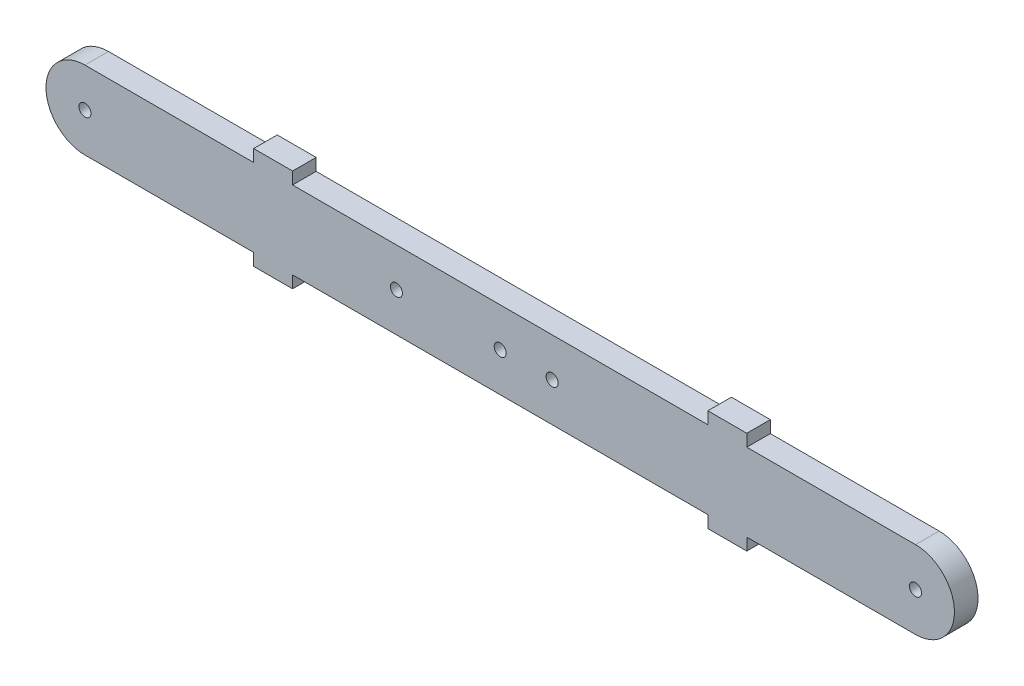
ISO-10303-21;
HEADER;
FILE_DESCRIPTION(('STEP AP214'),'2;1');
FILE_NAME('part.step','',(''),(''),'','','');
FILE_SCHEMA(('AUTOMOTIVE_DESIGN { 1 0 10303 214 1 1 1 1 }'));
ENDSEC;
DATA;
#1=APPLICATION_CONTEXT('core data for automotive mechanical design processes');
#2=APPLICATION_PROTOCOL_DEFINITION('international standard','automotive_design',2000,#1);
#3=PRODUCT_CONTEXT('',#1,'mechanical');
#4=PRODUCT('Part','Part','',(#3));
#5=PRODUCT_RELATED_PRODUCT_CATEGORY('part','',(#4));
#6=PRODUCT_DEFINITION_FORMATION('','',#4);
#7=PRODUCT_DEFINITION_CONTEXT('part definition',#1,'design');
#8=PRODUCT_DEFINITION('design','',#6,#7);
#9=PRODUCT_DEFINITION_SHAPE('','',#8);
#10=(LENGTH_UNIT() NAMED_UNIT(*) SI_UNIT(.MILLI.,.METRE.));
#11=(NAMED_UNIT(*) PLANE_ANGLE_UNIT() SI_UNIT($,.RADIAN.));
#12=(NAMED_UNIT(*) SI_UNIT($,.STERADIAN.) SOLID_ANGLE_UNIT());
#13=UNCERTAINTY_MEASURE_WITH_UNIT(LENGTH_MEASURE(1.E-05),#10,'distance_accuracy_value','');
#14=(GEOMETRIC_REPRESENTATION_CONTEXT(3) GLOBAL_UNCERTAINTY_ASSIGNED_CONTEXT((#13)) GLOBAL_UNIT_ASSIGNED_CONTEXT((#10,
#11,#12)) REPRESENTATION_CONTEXT('',''));
#15=CARTESIAN_POINT('',(0.,0.,0.));
#16=DIRECTION('',(0.,0.,1.));
#17=DIRECTION('',(1.,0.,0.));
#18=AXIS2_PLACEMENT_3D('',#15,#16,#17);
#19=CARTESIAN_POINT('',(-101.6,-9.525,5.7658));
#20=DIRECTION('',(0.,1.,0.));
#21=DIRECTION('',(-1.,0.,0.));
#22=AXIS2_PLACEMENT_3D('',#19,#20,#21);
#23=PLANE('',#22);
#24=DIRECTION('',(1.,0.,0.));
#25=VECTOR('',#24,1.);
#26=CARTESIAN_POINT('',(-101.6,-9.525,5.7658));
#27=LINE('',#26,#25);
#28=CARTESIAN_POINT('',(60.325,-9.52499999999997,5.7658));
#29=VERTEX_POINT('',#28);
#30=CARTESIAN_POINT('',(101.6,-9.52499999999996,5.7658));
#31=VERTEX_POINT('',#30);
#32=EDGE_CURVE('E58',#29,#31,#27,.T.);
#33=ORIENTED_EDGE('',*,*,#32,.F.);
#34=DIRECTION('',(0.,0.,1.));
#35=VECTOR('',#34,1.);
#36=CARTESIAN_POINT('',(60.325,-9.52500000000004,-9.97406124956128));
#37=LINE('',#36,#35);
#38=CARTESIAN_POINT('',(60.325,-9.52500000000004,0.));
#39=VERTEX_POINT('',#38);
#40=EDGE_CURVE('E207',#39,#29,#37,.T.);
#41=ORIENTED_EDGE('',*,*,#40,.F.);
#42=DIRECTION('',(1.,0.,0.));
#43=VECTOR('',#42,1.);
#44=CARTESIAN_POINT('',(-101.6,-9.525,0.));
#45=LINE('',#44,#43);
#46=CARTESIAN_POINT('',(101.6,-9.52499999999996,0.));
#47=VERTEX_POINT('',#46);
#48=EDGE_CURVE('E334',#39,#47,#45,.T.);
#49=ORIENTED_EDGE('',*,*,#48,.T.);
#50=DIRECTION('',(0.,0.,-1.));
#51=VECTOR('',#50,1.);
#52=CARTESIAN_POINT('',(101.6,-9.52499999999996,5.7658));
#53=LINE('',#52,#51);
#54=EDGE_CURVE('E43',#31,#47,#53,.T.);
#55=ORIENTED_EDGE('',*,*,#54,.F.);
#56=EDGE_LOOP('',(#33,#41,#49,#55));
#57=FACE_BOUND('',#56,.T.);
#58=ADVANCED_FACE('F35',(#57),#23,.F.);
#59=CARTESIAN_POINT('',(-101.6,-9.525,0.));
#60=VERTEX_POINT('',#59);
#61=CARTESIAN_POINT('',(-60.325,-9.52499999999999,0.));
#62=VERTEX_POINT('',#61);
#63=EDGE_CURVE('E335',#60,#62,#45,.T.);
#64=ORIENTED_EDGE('',*,*,#63,.T.);
#65=DIRECTION('',(0.,0.,1.));
#66=VECTOR('',#65,1.);
#67=CARTESIAN_POINT('',(-60.325,-9.52500000000005,-9.97406124956128));
#68=LINE('',#67,#66);
#69=CARTESIAN_POINT('',(-60.325,-9.52499999999999,5.7658));
#70=VERTEX_POINT('',#69);
#71=EDGE_CURVE('E217',#62,#70,#68,.T.);
#72=ORIENTED_EDGE('',*,*,#71,.T.);
#73=CARTESIAN_POINT('',(-101.6,-9.525,5.7658));
#74=VERTEX_POINT('',#73);
#75=EDGE_CURVE('E321',#74,#70,#27,.T.);
#76=ORIENTED_EDGE('',*,*,#75,.F.);
#77=DIRECTION('',(0.,0.,-1.));
#78=VECTOR('',#77,1.);
#79=CARTESIAN_POINT('',(-101.6,-9.525,5.7658));
#80=LINE('',#79,#78);
#81=EDGE_CURVE('E11',#74,#60,#80,.T.);
#82=ORIENTED_EDGE('',*,*,#81,.T.);
#83=EDGE_LOOP('',(#64,#72,#76,#82));
#84=FACE_BOUND('',#83,.T.);
#85=ADVANCED_FACE('F390',(#84),#23,.F.);
#86=CARTESIAN_POINT('',(-101.6,9.525,5.7658));
#87=DIRECTION('',(0.,-1.,0.));
#88=DIRECTION('',(1.,0.,0.));
#89=AXIS2_PLACEMENT_3D('',#86,#87,#88);
#90=PLANE('',#89);
#91=DIRECTION('',(-1.,0.,0.));
#92=VECTOR('',#91,1.);
#93=CARTESIAN_POINT('',(-101.6,9.525,5.7658));
#94=LINE('',#93,#92);
#95=CARTESIAN_POINT('',(-60.325,9.52500000000001,5.7658));
#96=VERTEX_POINT('',#95);
#97=CARTESIAN_POINT('',(-101.6,9.525,5.7658));
#98=VERTEX_POINT('',#97);
#99=EDGE_CURVE('E326',#96,#98,#94,.T.);
#100=ORIENTED_EDGE('',*,*,#99,.F.);
#101=DIRECTION('',(0.,0.,1.));
#102=VECTOR('',#101,1.);
#103=CARTESIAN_POINT('',(-60.325,9.52500000000004,-9.97406124956128));
#104=LINE('',#103,#102);
#105=CARTESIAN_POINT('',(-60.325,9.52500000000004,0.));
#106=VERTEX_POINT('',#105);
#107=EDGE_CURVE('E241',#106,#96,#104,.T.);
#108=ORIENTED_EDGE('',*,*,#107,.F.);
#109=DIRECTION('',(-1.,0.,0.));
#110=VECTOR('',#109,1.);
#111=CARTESIAN_POINT('',(-101.6,9.525,0.));
#112=LINE('',#111,#110);
#113=CARTESIAN_POINT('',(-101.6,9.525,0.));
#114=VERTEX_POINT('',#113);
#115=EDGE_CURVE('E339',#106,#114,#112,.T.);
#116=ORIENTED_EDGE('',*,*,#115,.T.);
#117=DIRECTION('',(0.,0.,-1.));
#118=VECTOR('',#117,1.);
#119=CARTESIAN_POINT('',(-101.6,9.525,5.7658));
#120=LINE('',#119,#118);
#121=EDGE_CURVE('E330',#98,#114,#120,.T.);
#122=ORIENTED_EDGE('',*,*,#121,.F.);
#123=EDGE_LOOP('',(#100,#108,#116,#122));
#124=FACE_BOUND('',#123,.T.);
#125=ADVANCED_FACE('F387',(#124),#90,.F.);
#126=CARTESIAN_POINT('',(101.6,9.52500000000004,0.));
#127=VERTEX_POINT('',#126);
#128=CARTESIAN_POINT('',(60.325,9.52500000000003,0.));
#129=VERTEX_POINT('',#128);
#130=EDGE_CURVE('E320',#127,#129,#112,.T.);
#131=ORIENTED_EDGE('',*,*,#130,.T.);
#132=DIRECTION('',(0.,0.,1.));
#133=VECTOR('',#132,1.);
#134=CARTESIAN_POINT('',(60.325,9.52500000000005,-9.97406124956128));
#135=LINE('',#134,#133);
#136=CARTESIAN_POINT('',(60.325,9.52500000000003,5.7658));
#137=VERTEX_POINT('',#136);
#138=EDGE_CURVE('E266',#129,#137,#135,.T.);
#139=ORIENTED_EDGE('',*,*,#138,.T.);
#140=CARTESIAN_POINT('',(101.6,9.52500000000004,5.7658));
#141=VERTEX_POINT('',#140);
#142=EDGE_CURVE('E327',#141,#137,#94,.T.);
#143=ORIENTED_EDGE('',*,*,#142,.F.);
#144=DIRECTION('',(0.,0.,-1.));
#145=VECTOR('',#144,1.);
#146=CARTESIAN_POINT('',(101.6,9.52500000000004,5.7658));
#147=LINE('',#146,#145);
#148=EDGE_CURVE('E344',#141,#127,#147,.T.);
#149=ORIENTED_EDGE('',*,*,#148,.T.);
#150=EDGE_LOOP('',(#131,#139,#143,#149));
#151=FACE_BOUND('',#150,.T.);
#152=ADVANCED_FACE('F360',(#151),#90,.F.);
#153=CARTESIAN_POINT('',(-101.6,0.,5.7658));
#154=DIRECTION('',(0.,0.,1.));
#155=DIRECTION('',(1.,0.,0.));
#156=AXIS2_PLACEMENT_3D('',#153,#154,#155);
#157=PLANE('',#156);
#158=CARTESIAN_POINT('',(-25.4,0.,5.7658));
#159=DIRECTION('',(0.,0.,1.));
#160=DIRECTION('',(1.,0.,0.));
#161=AXIS2_PLACEMENT_3D('',#158,#159,#160);
#162=CIRCLE('',#161,1.47319999999999);
#163=CARTESIAN_POINT('',(-23.9268,0.,5.7658));
#164=VERTEX_POINT('',#163);
#165=EDGE_CURVE('E287',#164,#164,#162,.T.);
#166=ORIENTED_EDGE('',*,*,#165,.F.);
#167=EDGE_LOOP('',(#166));
#168=FACE_BOUND('',#167,.T.);
#169=CARTESIAN_POINT('',(12.7,0.,5.7658));
#170=DIRECTION('',(0.,0.,1.));
#171=DIRECTION('',(1.,0.,0.));
#172=AXIS2_PLACEMENT_3D('',#169,#170,#171);
#173=CIRCLE('',#172,1.47319999999999);
#174=CARTESIAN_POINT('',(14.1732,0.,5.7658));
#175=VERTEX_POINT('',#174);
#176=EDGE_CURVE('E293',#175,#175,#173,.T.);
#177=ORIENTED_EDGE('',*,*,#176,.F.);
#178=EDGE_LOOP('',(#177));
#179=FACE_BOUND('',#178,.T.);
#180=CARTESIAN_POINT('',(0.,0.,5.7658));
#181=DIRECTION('',(0.,0.,1.));
#182=DIRECTION('',(1.,0.,0.));
#183=AXIS2_PLACEMENT_3D('',#180,#181,#182);
#184=CIRCLE('',#183,1.47319999999999);
#185=CARTESIAN_POINT('',(1.47319999999999,0.,5.7658));
#186=VERTEX_POINT('',#185);
#187=EDGE_CURVE('E299',#186,#186,#184,.T.);
#188=ORIENTED_EDGE('',*,*,#187,.F.);
#189=EDGE_LOOP('',(#188));
#190=FACE_BOUND('',#189,.T.);
#191=CARTESIAN_POINT('',(-101.6,0.,5.7658));
#192=DIRECTION('',(0.,0.,1.));
#193=DIRECTION('',(1.,0.,0.));
#194=AXIS2_PLACEMENT_3D('',#191,#192,#193);
#195=CIRCLE('',#194,1.4732);
#196=CARTESIAN_POINT('',(-100.1268,0.,5.7658));
#197=VERTEX_POINT('',#196);
#198=EDGE_CURVE('E312',#197,#197,#195,.T.);
#199=ORIENTED_EDGE('',*,*,#198,.F.);
#200=EDGE_LOOP('',(#199));
#201=FACE_BOUND('',#200,.T.);
#202=CARTESIAN_POINT('',(-101.6,0.,5.7658));
#203=DIRECTION('',(0.,0.,1.));
#204=DIRECTION('',(1.,0.,0.));
#205=AXIS2_PLACEMENT_3D('',#202,#203,#204);
#206=CIRCLE('',#205,9.525);
#207=EDGE_CURVE('E318',#98,#74,#206,.T.);
#208=ORIENTED_EDGE('',*,*,#207,.T.);
#209=ORIENTED_EDGE('',*,*,#75,.T.);
#210=DIRECTION('',(0.,-1.,0.));
#211=VECTOR('',#210,1.);
#212=CARTESIAN_POINT('',(-60.325,-9.52500000000005,5.7658));
#213=LINE('',#212,#211);
#214=CARTESIAN_POINT('',(-60.325,-12.4841,5.7658));
#215=VERTEX_POINT('',#214);
#216=EDGE_CURVE('E213',#70,#215,#213,.T.);
#217=ORIENTED_EDGE('',*,*,#216,.T.);
#218=DIRECTION('',(1.,0.,0.));
#219=VECTOR('',#218,1.);
#220=CARTESIAN_POINT('',(-60.325,-12.4841,5.7658));
#221=LINE('',#220,#219);
#222=CARTESIAN_POINT('',(-50.8,-12.4841,5.7658));
#223=VERTEX_POINT('',#222);
#224=EDGE_CURVE('E223',#215,#223,#221,.T.);
#225=ORIENTED_EDGE('',*,*,#224,.T.);
#226=DIRECTION('',(0.,1.,0.));
#227=VECTOR('',#226,1.);
#228=CARTESIAN_POINT('',(-50.8,-9.52500000000004,5.7658));
#229=LINE('',#228,#227);
#230=CARTESIAN_POINT('',(-50.8,-9.52499999999999,5.7658));
#231=VERTEX_POINT('',#230);
#232=EDGE_CURVE('E226',#223,#231,#229,.T.);
#233=ORIENTED_EDGE('',*,*,#232,.T.);
#234=CARTESIAN_POINT('',(50.8,-9.52499999999997,5.7658));
#235=VERTEX_POINT('',#234);
#236=EDGE_CURVE('E200',#231,#235,#27,.T.);
#237=ORIENTED_EDGE('',*,*,#236,.T.);
#238=DIRECTION('',(0.,-1.,0.));
#239=VECTOR('',#238,1.);
#240=CARTESIAN_POINT('',(50.8,-9.52500000000003,5.7658));
#241=LINE('',#240,#239);
#242=CARTESIAN_POINT('',(50.8,-12.4841,5.7658));
#243=VERTEX_POINT('',#242);
#244=EDGE_CURVE('E179',#235,#243,#241,.T.);
#245=ORIENTED_EDGE('',*,*,#244,.T.);
#246=DIRECTION('',(1.,0.,0.));
#247=VECTOR('',#246,1.);
#248=CARTESIAN_POINT('',(60.325,-12.4841,5.7658));
#249=LINE('',#248,#247);
#250=CARTESIAN_POINT('',(60.325,-12.4841,5.7658));
#251=VERTEX_POINT('',#250);
#252=EDGE_CURVE('E187',#243,#251,#249,.T.);
#253=ORIENTED_EDGE('',*,*,#252,.T.);
#254=DIRECTION('',(0.,1.,0.));
#255=VECTOR('',#254,1.);
#256=CARTESIAN_POINT('',(60.325,-9.52500000000004,5.7658));
#257=LINE('',#256,#255);
#258=EDGE_CURVE('E193',#251,#29,#257,.T.);
#259=ORIENTED_EDGE('',*,*,#258,.T.);
#260=ORIENTED_EDGE('',*,*,#32,.T.);
#261=CARTESIAN_POINT('',(101.6,0.,5.7658));
#262=DIRECTION('',(0.,0.,1.));
#263=DIRECTION('',(1.,0.,0.));
#264=AXIS2_PLACEMENT_3D('',#261,#262,#263);
#265=CIRCLE('',#264,9.525);
#266=EDGE_CURVE('E324',#31,#141,#265,.T.);
#267=ORIENTED_EDGE('',*,*,#266,.T.);
#268=ORIENTED_EDGE('',*,*,#142,.T.);
#269=DIRECTION('',(0.,1.,0.));
#270=VECTOR('',#269,1.);
#271=CARTESIAN_POINT('',(60.325,9.52500000000005,5.7658));
#272=LINE('',#271,#270);
#273=CARTESIAN_POINT('',(60.325,12.4841,5.7658));
#274=VERTEX_POINT('',#273);
#275=EDGE_CURVE('E262',#137,#274,#272,.T.);
#276=ORIENTED_EDGE('',*,*,#275,.T.);
#277=DIRECTION('',(-1.,0.,0.));
#278=VECTOR('',#277,1.);
#279=CARTESIAN_POINT('',(60.325,12.4841,5.7658));
#280=LINE('',#279,#278);
#281=CARTESIAN_POINT('',(50.8,12.4841,5.7658));
#282=VERTEX_POINT('',#281);
#283=EDGE_CURVE('E272',#274,#282,#280,.T.);
#284=ORIENTED_EDGE('',*,*,#283,.T.);
#285=DIRECTION('',(0.,-1.,0.));
#286=VECTOR('',#285,1.);
#287=CARTESIAN_POINT('',(50.8,9.52500000000004,5.7658));
#288=LINE('',#287,#286);
#289=CARTESIAN_POINT('',(50.8,9.52500000000003,5.7658));
#290=VERTEX_POINT('',#289);
#291=EDGE_CURVE('E275',#282,#290,#288,.T.);
#292=ORIENTED_EDGE('',*,*,#291,.T.);
#293=CARTESIAN_POINT('',(-50.8,9.52500000000001,5.7658));
#294=VERTEX_POINT('',#293);
#295=EDGE_CURVE('E331',#290,#294,#94,.T.);
#296=ORIENTED_EDGE('',*,*,#295,.T.);
#297=DIRECTION('',(0.,1.,0.));
#298=VECTOR('',#297,1.);
#299=CARTESIAN_POINT('',(-50.8,9.52500000000002,5.7658));
#300=LINE('',#299,#298);
#301=CARTESIAN_POINT('',(-50.8,12.4841,5.7658));
#302=VERTEX_POINT('',#301);
#303=EDGE_CURVE('E237',#294,#302,#300,.T.);
#304=ORIENTED_EDGE('',*,*,#303,.T.);
#305=DIRECTION('',(-1.,0.,0.));
#306=VECTOR('',#305,1.);
#307=CARTESIAN_POINT('',(-60.325,12.4841,5.7658));
#308=LINE('',#307,#306);
#309=CARTESIAN_POINT('',(-60.325,12.4841,5.7658));
#310=VERTEX_POINT('',#309);
#311=EDGE_CURVE('E246',#302,#310,#308,.T.);
#312=ORIENTED_EDGE('',*,*,#311,.T.);
#313=DIRECTION('',(0.,-1.,0.));
#314=VECTOR('',#313,1.);
#315=CARTESIAN_POINT('',(-60.325,9.52500000000004,5.7658));
#316=LINE('',#315,#314);
#317=EDGE_CURVE('E249',#310,#96,#316,.T.);
#318=ORIENTED_EDGE('',*,*,#317,.T.);
#319=ORIENTED_EDGE('',*,*,#99,.T.);
#320=EDGE_LOOP('',(#208,#209,#217,#225,#233,#237,#245,#253,#259,#260,#267,#268,#276,#284,#292,
#296,#304,#312,#318,#319));
#321=FACE_BOUND('',#320,.T.);
#322=CARTESIAN_POINT('',(101.6,0.,5.7658));
#323=DIRECTION('',(0.,0.,1.));
#324=DIRECTION('',(1.,0.,0.));
#325=AXIS2_PLACEMENT_3D('',#322,#323,#324);
#326=CIRCLE('',#325,1.4732);
#327=CARTESIAN_POINT('',(103.0732,0.,5.7658));
#328=VERTEX_POINT('',#327);
#329=EDGE_CURVE('E306',#328,#328,#326,.T.);
#330=ORIENTED_EDGE('',*,*,#329,.F.);
#331=EDGE_LOOP('',(#330));
#332=FACE_BOUND('',#331,.T.);
#333=ADVANCED_FACE('F197',(#168,#179,#190,#201,#321,#332),#157,.T.);
#334=CARTESIAN_POINT('',(-101.6,0.,0.));
#335=DIRECTION('',(0.,0.,1.));
#336=DIRECTION('',(1.,0.,0.));
#337=AXIS2_PLACEMENT_3D('',#334,#335,#336);
#338=PLANE('',#337);
#339=CARTESIAN_POINT('',(-25.4,0.,0.));
#340=DIRECTION('',(0.,0.,1.));
#341=DIRECTION('',(1.,0.,0.));
#342=AXIS2_PLACEMENT_3D('',#339,#340,#341);
#343=CIRCLE('',#342,1.4732);
#344=CARTESIAN_POINT('',(-23.9268,0.,0.));
#345=VERTEX_POINT('',#344);
#346=EDGE_CURVE('E290',#345,#345,#343,.T.);
#347=ORIENTED_EDGE('',*,*,#346,.T.);
#348=EDGE_LOOP('',(#347));
#349=FACE_BOUND('',#348,.T.);
#350=CARTESIAN_POINT('',(12.7,0.,0.));
#351=DIRECTION('',(0.,0.,1.));
#352=DIRECTION('',(1.,0.,0.));
#353=AXIS2_PLACEMENT_3D('',#350,#351,#352);
#354=CIRCLE('',#353,1.4732);
#355=CARTESIAN_POINT('',(14.1732,0.,0.));
#356=VERTEX_POINT('',#355);
#357=EDGE_CURVE('E296',#356,#356,#354,.T.);
#358=ORIENTED_EDGE('',*,*,#357,.T.);
#359=EDGE_LOOP('',(#358));
#360=FACE_BOUND('',#359,.T.);
#361=CARTESIAN_POINT('',(0.,0.,0.));
#362=DIRECTION('',(0.,0.,1.));
#363=DIRECTION('',(1.,0.,0.));
#364=AXIS2_PLACEMENT_3D('',#361,#362,#363);
#365=CIRCLE('',#364,1.4732);
#366=CARTESIAN_POINT('',(1.4732,0.,0.));
#367=VERTEX_POINT('',#366);
#368=EDGE_CURVE('E302',#367,#367,#365,.T.);
#369=ORIENTED_EDGE('',*,*,#368,.T.);
#370=EDGE_LOOP('',(#369));
#371=FACE_BOUND('',#370,.T.);
#372=CARTESIAN_POINT('',(-101.6,0.,0.));
#373=DIRECTION('',(0.,0.,1.));
#374=DIRECTION('',(1.,0.,0.));
#375=AXIS2_PLACEMENT_3D('',#372,#373,#374);
#376=CIRCLE('',#375,1.4732);
#377=CARTESIAN_POINT('',(-100.1268,0.,0.));
#378=VERTEX_POINT('',#377);
#379=EDGE_CURVE('E309',#378,#378,#376,.T.);
#380=ORIENTED_EDGE('',*,*,#379,.T.);
#381=EDGE_LOOP('',(#380));
#382=FACE_BOUND('',#381,.T.);
#383=CARTESIAN_POINT('',(-101.6,0.,0.));
#384=DIRECTION('',(0.,0.,1.));
#385=DIRECTION('',(1.,0.,0.));
#386=AXIS2_PLACEMENT_3D('',#383,#384,#385);
#387=CIRCLE('',#386,9.525);
#388=EDGE_CURVE('E315',#114,#60,#387,.T.);
#389=ORIENTED_EDGE('',*,*,#388,.F.);
#390=ORIENTED_EDGE('',*,*,#115,.F.);
#391=DIRECTION('',(0.,1.,0.));
#392=VECTOR('',#391,1.);
#393=CARTESIAN_POINT('',(-60.325,9.52500000000004,0.));
#394=LINE('',#393,#392);
#395=CARTESIAN_POINT('',(-60.325,12.4841,0.));
#396=VERTEX_POINT('',#395);
#397=EDGE_CURVE('E240',#106,#396,#394,.T.);
#398=ORIENTED_EDGE('',*,*,#397,.T.);
#399=DIRECTION('',(1.,0.,0.));
#400=VECTOR('',#399,1.);
#401=CARTESIAN_POINT('',(-60.325,12.4841,0.));
#402=LINE('',#401,#400);
#403=CARTESIAN_POINT('',(-50.8,12.4841,0.));
#404=VERTEX_POINT('',#403);
#405=EDGE_CURVE('E238',#396,#404,#402,.T.);
#406=ORIENTED_EDGE('',*,*,#405,.T.);
#407=DIRECTION('',(0.,-1.,0.));
#408=VECTOR('',#407,1.);
#409=CARTESIAN_POINT('',(-50.8,9.52500000000002,0.));
#410=LINE('',#409,#408);
#411=CARTESIAN_POINT('',(-50.8,9.52500000000001,0.));
#412=VERTEX_POINT('',#411);
#413=EDGE_CURVE('E243',#404,#412,#410,.T.);
#414=ORIENTED_EDGE('',*,*,#413,.T.);
#415=CARTESIAN_POINT('',(50.8,9.52500000000004,0.));
#416=VERTEX_POINT('',#415);
#417=EDGE_CURVE('E341',#416,#412,#112,.T.);
#418=ORIENTED_EDGE('',*,*,#417,.F.);
#419=DIRECTION('',(0.,1.,0.));
#420=VECTOR('',#419,1.);
#421=CARTESIAN_POINT('',(50.8,9.52500000000004,0.));
#422=LINE('',#421,#420);
#423=CARTESIAN_POINT('',(50.8,12.4841,0.));
#424=VERTEX_POINT('',#423);
#425=EDGE_CURVE('E263',#416,#424,#422,.T.);
#426=ORIENTED_EDGE('',*,*,#425,.T.);
#427=DIRECTION('',(1.,0.,0.));
#428=VECTOR('',#427,1.);
#429=CARTESIAN_POINT('',(60.325,12.4841,0.));
#430=LINE('',#429,#428);
#431=CARTESIAN_POINT('',(60.325,12.4841,0.));
#432=VERTEX_POINT('',#431);
#433=EDGE_CURVE('E269',#424,#432,#430,.T.);
#434=ORIENTED_EDGE('',*,*,#433,.T.);
#435=DIRECTION('',(0.,-1.,0.));
#436=VECTOR('',#435,1.);
#437=CARTESIAN_POINT('',(60.325,9.52500000000005,0.));
#438=LINE('',#437,#436);
#439=EDGE_CURVE('E265',#432,#129,#438,.T.);
#440=ORIENTED_EDGE('',*,*,#439,.T.);
#441=ORIENTED_EDGE('',*,*,#130,.F.);
#442=CARTESIAN_POINT('',(101.6,0.,0.));
#443=DIRECTION('',(0.,0.,1.));
#444=DIRECTION('',(1.,0.,0.));
#445=AXIS2_PLACEMENT_3D('',#442,#443,#444);
#446=CIRCLE('',#445,9.525);
#447=EDGE_CURVE('E337',#47,#127,#446,.T.);
#448=ORIENTED_EDGE('',*,*,#447,.F.);
#449=ORIENTED_EDGE('',*,*,#48,.F.);
#450=DIRECTION('',(0.,-1.,0.));
#451=VECTOR('',#450,1.);
#452=CARTESIAN_POINT('',(60.325,-9.52500000000004,0.));
#453=LINE('',#452,#451);
#454=CARTESIAN_POINT('',(60.325,-12.4841,0.));
#455=VERTEX_POINT('',#454);
#456=EDGE_CURVE('E203',#39,#455,#453,.T.);
#457=ORIENTED_EDGE('',*,*,#456,.T.);
#458=DIRECTION('',(-1.,0.,0.));
#459=VECTOR('',#458,1.);
#460=CARTESIAN_POINT('',(60.325,-12.4841,0.));
#461=LINE('',#460,#459);
#462=CARTESIAN_POINT('',(50.8,-12.4841,0.));
#463=VERTEX_POINT('',#462);
#464=EDGE_CURVE('E209',#455,#463,#461,.T.);
#465=ORIENTED_EDGE('',*,*,#464,.T.);
#466=DIRECTION('',(0.,1.,0.));
#467=VECTOR('',#466,1.);
#468=CARTESIAN_POINT('',(50.8,-9.52500000000003,0.));
#469=LINE('',#468,#467);
#470=CARTESIAN_POINT('',(50.8,-9.52499999999997,0.));
#471=VERTEX_POINT('',#470);
#472=EDGE_CURVE('E180',#463,#471,#469,.T.);
#473=ORIENTED_EDGE('',*,*,#472,.T.);
#474=CARTESIAN_POINT('',(-50.8,-9.52500000000004,0.));
#475=VERTEX_POINT('',#474);
#476=EDGE_CURVE('E50',#475,#471,#45,.T.);
#477=ORIENTED_EDGE('',*,*,#476,.F.);
#478=DIRECTION('',(0.,-1.,0.));
#479=VECTOR('',#478,1.);
#480=CARTESIAN_POINT('',(-50.8,-9.52500000000004,0.));
#481=LINE('',#480,#479);
#482=CARTESIAN_POINT('',(-50.8,-12.4841,0.));
#483=VERTEX_POINT('',#482);
#484=EDGE_CURVE('E214',#475,#483,#481,.T.);
#485=ORIENTED_EDGE('',*,*,#484,.T.);
#486=DIRECTION('',(-1.,0.,0.));
#487=VECTOR('',#486,1.);
#488=CARTESIAN_POINT('',(-60.325,-12.4841,0.));
#489=LINE('',#488,#487);
#490=CARTESIAN_POINT('',(-60.325,-12.4841,0.));
#491=VERTEX_POINT('',#490);
#492=EDGE_CURVE('E220',#483,#491,#489,.T.);
#493=ORIENTED_EDGE('',*,*,#492,.T.);
#494=DIRECTION('',(0.,1.,0.));
#495=VECTOR('',#494,1.);
#496=CARTESIAN_POINT('',(-60.325,-9.52500000000005,0.));
#497=LINE('',#496,#495);
#498=EDGE_CURVE('E216',#491,#62,#497,.T.);
#499=ORIENTED_EDGE('',*,*,#498,.T.);
#500=ORIENTED_EDGE('',*,*,#63,.F.);
#501=EDGE_LOOP('',(#389,#390,#398,#406,#414,#418,#426,#434,#440,#441,#448,#449,#457,#465,#473,
#477,#485,#493,#499,#500));
#502=FACE_BOUND('',#501,.T.);
#503=CARTESIAN_POINT('',(101.6,0.,0.));
#504=DIRECTION('',(0.,0.,1.));
#505=DIRECTION('',(1.,0.,0.));
#506=AXIS2_PLACEMENT_3D('',#503,#504,#505);
#507=CIRCLE('',#506,1.4732);
#508=CARTESIAN_POINT('',(103.0732,0.,0.));
#509=VERTEX_POINT('',#508);
#510=EDGE_CURVE('E305',#509,#509,#507,.T.);
#511=ORIENTED_EDGE('',*,*,#510,.T.);
#512=EDGE_LOOP('',(#511));
#513=FACE_BOUND('',#512,.T.);
#514=ADVANCED_FACE('F355',(#349,#360,#371,#382,#502,#513),#338,.F.);
#515=CARTESIAN_POINT('',(-101.6,0.,5.7658));
#516=DIRECTION('',(0.,0.,-1.));
#517=DIRECTION('',(-1.,0.,0.));
#518=AXIS2_PLACEMENT_3D('',#515,#516,#517);
#519=CYLINDRICAL_SURFACE('',#518,9.525);
#520=ORIENTED_EDGE('',*,*,#388,.T.);
#521=ORIENTED_EDGE('',*,*,#81,.F.);
#522=ORIENTED_EDGE('',*,*,#207,.F.);
#523=ORIENTED_EDGE('',*,*,#121,.T.);
#524=EDGE_LOOP('',(#520,#521,#522,#523));
#525=FACE_BOUND('',#524,.T.);
#526=ADVANCED_FACE('F37',(#525),#519,.T.);
#527=ORIENTED_EDGE('',*,*,#476,.T.);
#528=DIRECTION('',(0.,0.,1.));
#529=VECTOR('',#528,1.);
#530=CARTESIAN_POINT('',(50.8,-9.52500000000003,-9.97406124956128));
#531=LINE('',#530,#529);
#532=EDGE_CURVE('E184',#471,#235,#531,.T.);
#533=ORIENTED_EDGE('',*,*,#532,.T.);
#534=ORIENTED_EDGE('',*,*,#236,.F.);
#535=DIRECTION('',(0.,0.,1.));
#536=VECTOR('',#535,1.);
#537=CARTESIAN_POINT('',(-50.8,-9.52500000000004,-9.97406124956128));
#538=LINE('',#537,#536);
#539=EDGE_CURVE('E230',#475,#231,#538,.T.);
#540=ORIENTED_EDGE('',*,*,#539,.F.);
#541=EDGE_LOOP('',(#527,#533,#534,#540));
#542=FACE_BOUND('',#541,.T.);
#543=ADVANCED_FACE('F406',(#542),#23,.F.);
#544=CARTESIAN_POINT('',(101.6,0.,5.7658));
#545=DIRECTION('',(0.,0.,-1.));
#546=DIRECTION('',(-1.,0.,0.));
#547=AXIS2_PLACEMENT_3D('',#544,#545,#546);
#548=CYLINDRICAL_SURFACE('',#547,9.525);
#549=ORIENTED_EDGE('',*,*,#447,.T.);
#550=ORIENTED_EDGE('',*,*,#148,.F.);
#551=ORIENTED_EDGE('',*,*,#266,.F.);
#552=ORIENTED_EDGE('',*,*,#54,.T.);
#553=EDGE_LOOP('',(#549,#550,#551,#552));
#554=FACE_BOUND('',#553,.T.);
#555=ADVANCED_FACE('F350',(#554),#548,.T.);
#556=ORIENTED_EDGE('',*,*,#417,.T.);
#557=DIRECTION('',(0.,0.,1.));
#558=VECTOR('',#557,1.);
#559=CARTESIAN_POINT('',(-50.8,9.52500000000002,-9.97406124956128));
#560=LINE('',#559,#558);
#561=EDGE_CURVE('E252',#412,#294,#560,.T.);
#562=ORIENTED_EDGE('',*,*,#561,.T.);
#563=ORIENTED_EDGE('',*,*,#295,.F.);
#564=DIRECTION('',(0.,0.,1.));
#565=VECTOR('',#564,1.);
#566=CARTESIAN_POINT('',(50.8,9.52500000000004,-9.97406124956128));
#567=LINE('',#566,#565);
#568=EDGE_CURVE('E280',#416,#290,#567,.T.);
#569=ORIENTED_EDGE('',*,*,#568,.F.);
#570=EDGE_LOOP('',(#556,#562,#563,#569));
#571=FACE_BOUND('',#570,.T.);
#572=ADVANCED_FACE('F379',(#571),#90,.F.);
#573=CARTESIAN_POINT('',(-101.6,0.,5.7658));
#574=DIRECTION('',(0.,0.,-1.));
#575=DIRECTION('',(-1.,0.,0.));
#576=AXIS2_PLACEMENT_3D('',#573,#574,#575);
#577=CYLINDRICAL_SURFACE('',#576,1.4732);
#578=ORIENTED_EDGE('',*,*,#198,.T.);
#579=EDGE_LOOP('',(#578));
#580=FACE_BOUND('',#579,.T.);
#581=ORIENTED_EDGE('',*,*,#379,.F.);
#582=EDGE_LOOP('',(#581));
#583=FACE_BOUND('',#582,.T.);
#584=ADVANCED_FACE('F434',(#580,#583),#577,.F.);
#585=CARTESIAN_POINT('',(101.6,0.,5.7658));
#586=DIRECTION('',(0.,0.,-1.));
#587=DIRECTION('',(-1.,0.,0.));
#588=AXIS2_PLACEMENT_3D('',#585,#586,#587);
#589=CYLINDRICAL_SURFACE('',#588,1.4732);
#590=ORIENTED_EDGE('',*,*,#329,.T.);
#591=EDGE_LOOP('',(#590));
#592=FACE_BOUND('',#591,.T.);
#593=ORIENTED_EDGE('',*,*,#510,.F.);
#594=EDGE_LOOP('',(#593));
#595=FACE_BOUND('',#594,.T.);
#596=ADVANCED_FACE('F438',(#592,#595),#589,.F.);
#597=CARTESIAN_POINT('',(0.,0.,5.7658));
#598=DIRECTION('',(0.,0.,1.));
#599=DIRECTION('',(1.,0.,0.));
#600=AXIS2_PLACEMENT_3D('',#597,#598,#599);
#601=CYLINDRICAL_SURFACE('',#600,1.47319999999999);
#602=ORIENTED_EDGE('',*,*,#368,.F.);
#603=EDGE_LOOP('',(#602));
#604=FACE_BOUND('',#603,.T.);
#605=ORIENTED_EDGE('',*,*,#187,.T.);
#606=EDGE_LOOP('',(#605));
#607=FACE_BOUND('',#606,.T.);
#608=ADVANCED_FACE('F582',(#604,#607),#601,.F.);
#609=CARTESIAN_POINT('',(12.7,0.,5.7658));
#610=DIRECTION('',(0.,0.,1.));
#611=DIRECTION('',(1.,0.,0.));
#612=AXIS2_PLACEMENT_3D('',#609,#610,#611);
#613=CYLINDRICAL_SURFACE('',#612,1.47319999999999);
#614=ORIENTED_EDGE('',*,*,#357,.F.);
#615=EDGE_LOOP('',(#614));
#616=FACE_BOUND('',#615,.T.);
#617=ORIENTED_EDGE('',*,*,#176,.T.);
#618=EDGE_LOOP('',(#617));
#619=FACE_BOUND('',#618,.T.);
#620=ADVANCED_FACE('F578',(#616,#619),#613,.F.);
#621=CARTESIAN_POINT('',(-25.4,0.,5.7658));
#622=DIRECTION('',(0.,0.,1.));
#623=DIRECTION('',(1.,0.,0.));
#624=AXIS2_PLACEMENT_3D('',#621,#622,#623);
#625=CYLINDRICAL_SURFACE('',#624,1.47319999999999);
#626=ORIENTED_EDGE('',*,*,#346,.F.);
#627=EDGE_LOOP('',(#626));
#628=FACE_BOUND('',#627,.T.);
#629=ORIENTED_EDGE('',*,*,#165,.T.);
#630=EDGE_LOOP('',(#629));
#631=FACE_BOUND('',#630,.T.);
#632=ADVANCED_FACE('F477',(#628,#631),#625,.F.);
#633=CARTESIAN_POINT('',(60.325,9.52500000000005,-9.97406124956128));
#634=DIRECTION('',(1.,0.,0.));
#635=DIRECTION('',(0.,0.,-1.));
#636=AXIS2_PLACEMENT_3D('',#633,#634,#635);
#637=PLANE('',#636);
#638=ORIENTED_EDGE('',*,*,#439,.F.);
#639=DIRECTION('',(0.,0.,1.));
#640=VECTOR('',#639,1.);
#641=CARTESIAN_POINT('',(60.325,12.4841,-9.97406124956128));
#642=LINE('',#641,#640);
#643=EDGE_CURVE('E278',#432,#274,#642,.T.);
#644=ORIENTED_EDGE('',*,*,#643,.T.);
#645=ORIENTED_EDGE('',*,*,#275,.F.);
#646=ORIENTED_EDGE('',*,*,#138,.F.);
#647=EDGE_LOOP('',(#638,#644,#645,#646));
#648=FACE_BOUND('',#647,.T.);
#649=ADVANCED_FACE('F364',(#648),#637,.T.);
#650=CARTESIAN_POINT('',(50.8,9.52500000000004,-9.97406124956128));
#651=DIRECTION('',(-1.,0.,0.));
#652=DIRECTION('',(0.,0.,1.));
#653=AXIS2_PLACEMENT_3D('',#650,#651,#652);
#654=PLANE('',#653);
#655=ORIENTED_EDGE('',*,*,#425,.F.);
#656=ORIENTED_EDGE('',*,*,#568,.T.);
#657=ORIENTED_EDGE('',*,*,#291,.F.);
#658=DIRECTION('',(0.,0.,1.));
#659=VECTOR('',#658,1.);
#660=CARTESIAN_POINT('',(50.8,12.4841,-9.97406124956128));
#661=LINE('',#660,#659);
#662=EDGE_CURVE('E283',#424,#282,#661,.T.);
#663=ORIENTED_EDGE('',*,*,#662,.F.);
#664=EDGE_LOOP('',(#655,#656,#657,#663));
#665=FACE_BOUND('',#664,.T.);
#666=ADVANCED_FACE('F376',(#665),#654,.T.);
#667=CARTESIAN_POINT('',(60.325,12.4841,-9.97406124956128));
#668=DIRECTION('',(0.,1.,0.));
#669=DIRECTION('',(0.,0.,1.));
#670=AXIS2_PLACEMENT_3D('',#667,#668,#669);
#671=PLANE('',#670);
#672=ORIENTED_EDGE('',*,*,#433,.F.);
#673=ORIENTED_EDGE('',*,*,#662,.T.);
#674=ORIENTED_EDGE('',*,*,#283,.F.);
#675=ORIENTED_EDGE('',*,*,#643,.F.);
#676=EDGE_LOOP('',(#672,#673,#674,#675));
#677=FACE_BOUND('',#676,.T.);
#678=ADVANCED_FACE('F369',(#677),#671,.T.);
#679=CARTESIAN_POINT('',(-60.325,9.52500000000004,-9.97406124956128));
#680=DIRECTION('',(-1.,0.,0.));
#681=DIRECTION('',(0.,0.,1.));
#682=AXIS2_PLACEMENT_3D('',#679,#680,#681);
#683=PLANE('',#682);
#684=ORIENTED_EDGE('',*,*,#397,.F.);
#685=ORIENTED_EDGE('',*,*,#107,.T.);
#686=ORIENTED_EDGE('',*,*,#317,.F.);
#687=DIRECTION('',(0.,0.,1.));
#688=VECTOR('',#687,1.);
#689=CARTESIAN_POINT('',(-60.325,12.4841,-9.97406124956128));
#690=LINE('',#689,#688);
#691=EDGE_CURVE('E255',#396,#310,#690,.T.);
#692=ORIENTED_EDGE('',*,*,#691,.F.);
#693=EDGE_LOOP('',(#684,#685,#686,#692));
#694=FACE_BOUND('',#693,.T.);
#695=ADVANCED_FACE('F495',(#694),#683,.T.);
#696=CARTESIAN_POINT('',(-60.325,12.4841,-9.97406124956128));
#697=DIRECTION('',(0.,1.,0.));
#698=DIRECTION('',(-1.,0.,0.));
#699=AXIS2_PLACEMENT_3D('',#696,#697,#698);
#700=PLANE('',#699);
#701=ORIENTED_EDGE('',*,*,#405,.F.);
#702=ORIENTED_EDGE('',*,*,#691,.T.);
#703=ORIENTED_EDGE('',*,*,#311,.F.);
#704=DIRECTION('',(0.,0.,1.));
#705=VECTOR('',#704,1.);
#706=CARTESIAN_POINT('',(-50.8,12.4841,-9.97406124956128));
#707=LINE('',#706,#705);
#708=EDGE_CURVE('E257',#404,#302,#707,.T.);
#709=ORIENTED_EDGE('',*,*,#708,.F.);
#710=EDGE_LOOP('',(#701,#702,#703,#709));
#711=FACE_BOUND('',#710,.T.);
#712=ADVANCED_FACE('F504',(#711),#700,.T.);
#713=CARTESIAN_POINT('',(-50.8,9.52500000000002,-9.97406124956128));
#714=DIRECTION('',(1.,0.,0.));
#715=DIRECTION('',(0.,0.,-1.));
#716=AXIS2_PLACEMENT_3D('',#713,#714,#715);
#717=PLANE('',#716);
#718=ORIENTED_EDGE('',*,*,#413,.F.);
#719=ORIENTED_EDGE('',*,*,#708,.T.);
#720=ORIENTED_EDGE('',*,*,#303,.F.);
#721=ORIENTED_EDGE('',*,*,#561,.F.);
#722=EDGE_LOOP('',(#718,#719,#720,#721));
#723=FACE_BOUND('',#722,.T.);
#724=ADVANCED_FACE('F514',(#723),#717,.T.);
#725=CARTESIAN_POINT('',(-60.325,-9.52500000000005,-9.97406124956128));
#726=DIRECTION('',(-1.,0.,0.));
#727=DIRECTION('',(0.,0.,1.));
#728=AXIS2_PLACEMENT_3D('',#725,#726,#727);
#729=PLANE('',#728);
#730=ORIENTED_EDGE('',*,*,#498,.F.);
#731=DIRECTION('',(0.,0.,1.));
#732=VECTOR('',#731,1.);
#733=CARTESIAN_POINT('',(-60.325,-12.4841,-9.97406124956128));
#734=LINE('',#733,#732);
#735=EDGE_CURVE('E228',#491,#215,#734,.T.);
#736=ORIENTED_EDGE('',*,*,#735,.T.);
#737=ORIENTED_EDGE('',*,*,#216,.F.);
#738=ORIENTED_EDGE('',*,*,#71,.F.);
#739=EDGE_LOOP('',(#730,#736,#737,#738));
#740=FACE_BOUND('',#739,.T.);
#741=ADVANCED_FACE('F395',(#740),#729,.T.);
#742=CARTESIAN_POINT('',(-50.8,-9.52500000000004,-9.97406124956128));
#743=DIRECTION('',(1.,0.,0.));
#744=DIRECTION('',(0.,0.,-1.));
#745=AXIS2_PLACEMENT_3D('',#742,#743,#744);
#746=PLANE('',#745);
#747=ORIENTED_EDGE('',*,*,#484,.F.);
#748=ORIENTED_EDGE('',*,*,#539,.T.);
#749=ORIENTED_EDGE('',*,*,#232,.F.);
#750=DIRECTION('',(0.,0.,1.));
#751=VECTOR('',#750,1.);
#752=CARTESIAN_POINT('',(-50.8,-12.4841,-9.97406124956128));
#753=LINE('',#752,#751);
#754=EDGE_CURVE('E233',#483,#223,#753,.T.);
#755=ORIENTED_EDGE('',*,*,#754,.F.);
#756=EDGE_LOOP('',(#747,#748,#749,#755));
#757=FACE_BOUND('',#756,.T.);
#758=ADVANCED_FACE('F405',(#757),#746,.T.);
#759=CARTESIAN_POINT('',(-60.325,-12.4841,-9.97406124956128));
#760=DIRECTION('',(0.,-1.,0.));
#761=DIRECTION('',(0.,0.,-1.));
#762=AXIS2_PLACEMENT_3D('',#759,#760,#761);
#763=PLANE('',#762);
#764=ORIENTED_EDGE('',*,*,#492,.F.);
#765=ORIENTED_EDGE('',*,*,#754,.T.);
#766=ORIENTED_EDGE('',*,*,#224,.F.);
#767=ORIENTED_EDGE('',*,*,#735,.F.);
#768=EDGE_LOOP('',(#764,#765,#766,#767));
#769=FACE_BOUND('',#768,.T.);
#770=ADVANCED_FACE('F400',(#769),#763,.T.);
#771=CARTESIAN_POINT('',(60.325,-9.52500000000004,-9.97406124956128));
#772=DIRECTION('',(1.,0.,0.));
#773=DIRECTION('',(0.,0.,-1.));
#774=AXIS2_PLACEMENT_3D('',#771,#772,#773);
#775=PLANE('',#774);
#776=ORIENTED_EDGE('',*,*,#456,.F.);
#777=ORIENTED_EDGE('',*,*,#40,.T.);
#778=ORIENTED_EDGE('',*,*,#258,.F.);
#779=DIRECTION('',(0.,0.,1.));
#780=VECTOR('',#779,1.);
#781=CARTESIAN_POINT('',(60.325,-12.4841,-9.97406124956128));
#782=LINE('',#781,#780);
#783=EDGE_CURVE('E183',#455,#251,#782,.T.);
#784=ORIENTED_EDGE('',*,*,#783,.F.);
#785=EDGE_LOOP('',(#776,#777,#778,#784));
#786=FACE_BOUND('',#785,.T.);
#787=ADVANCED_FACE('F409',(#786),#775,.T.);
#788=CARTESIAN_POINT('',(60.325,-12.4841,-9.97406124956128));
#789=DIRECTION('',(0.,-1.,0.));
#790=DIRECTION('',(1.,0.,0.));
#791=AXIS2_PLACEMENT_3D('',#788,#789,#790);
#792=PLANE('',#791);
#793=ORIENTED_EDGE('',*,*,#464,.F.);
#794=ORIENTED_EDGE('',*,*,#783,.T.);
#795=ORIENTED_EDGE('',*,*,#252,.F.);
#796=DIRECTION('',(0.,0.,1.));
#797=VECTOR('',#796,1.);
#798=CARTESIAN_POINT('',(50.8,-12.4841,-9.97406124956128));
#799=LINE('',#798,#797);
#800=EDGE_CURVE('E174',#463,#243,#799,.T.);
#801=ORIENTED_EDGE('',*,*,#800,.F.);
#802=EDGE_LOOP('',(#793,#794,#795,#801));
#803=FACE_BOUND('',#802,.T.);
#804=ADVANCED_FACE('F188',(#803),#792,.T.);
#805=CARTESIAN_POINT('',(50.8,-9.52500000000003,-9.97406124956128));
#806=DIRECTION('',(-1.,0.,0.));
#807=DIRECTION('',(0.,0.,1.));
#808=AXIS2_PLACEMENT_3D('',#805,#806,#807);
#809=PLANE('',#808);
#810=ORIENTED_EDGE('',*,*,#472,.F.);
#811=ORIENTED_EDGE('',*,*,#800,.T.);
#812=ORIENTED_EDGE('',*,*,#244,.F.);
#813=ORIENTED_EDGE('',*,*,#532,.F.);
#814=EDGE_LOOP('',(#810,#811,#812,#813));
#815=FACE_BOUND('',#814,.T.);
#816=ADVANCED_FACE('F176',(#815),#809,.T.);
#817=CLOSED_SHELL('',(#58,#85,#125,#152,#333,#514,#526,#543,#555,#572,#584,#596,#608,#620,#632,
#649,#666,#678,#695,#712,#724,#741,#758,#770,#787,#804,#816));
#818=MANIFOLD_SOLID_BREP('B2',#817);
#819=ADVANCED_BREP_SHAPE_REPRESENTATION('',(#18,#818),#14);
#820=SHAPE_DEFINITION_REPRESENTATION(#9,#819);
ENDSEC;
END-ISO-10303-21;
